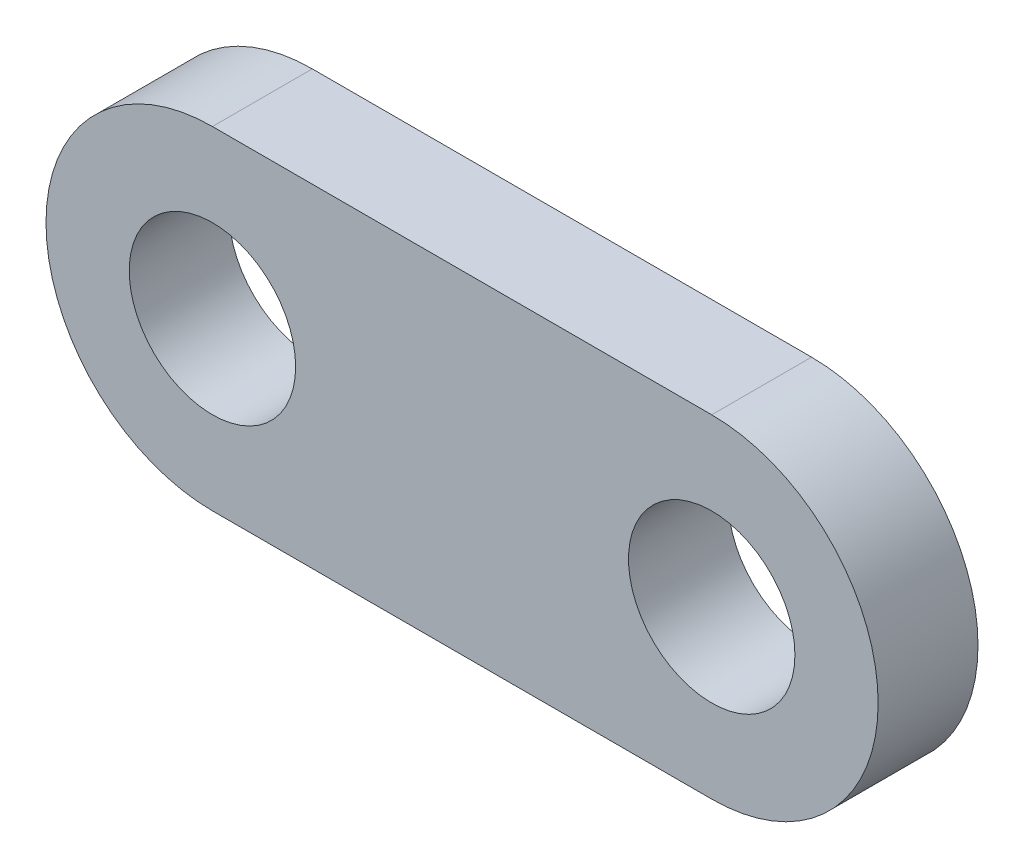
ISO-10303-21;
HEADER;
FILE_DESCRIPTION(('STEP AP214'),'2;1');
FILE_NAME('part.step','',(''),(''),'','','');
FILE_SCHEMA(('AUTOMOTIVE_DESIGN { 1 0 10303 214 1 1 1 1 }'));
ENDSEC;
DATA;
#1=APPLICATION_CONTEXT('core data for automotive mechanical design processes');
#2=APPLICATION_PROTOCOL_DEFINITION('international standard','automotive_design',2000,#1);
#3=PRODUCT_CONTEXT('',#1,'mechanical');
#4=PRODUCT('Part','Part','',(#3));
#5=PRODUCT_RELATED_PRODUCT_CATEGORY('part','',(#4));
#6=PRODUCT_DEFINITION_FORMATION('','',#4);
#7=PRODUCT_DEFINITION_CONTEXT('part definition',#1,'design');
#8=PRODUCT_DEFINITION('design','',#6,#7);
#9=PRODUCT_DEFINITION_SHAPE('','',#8);
#10=(LENGTH_UNIT() NAMED_UNIT(*) SI_UNIT(.MILLI.,.METRE.));
#11=(NAMED_UNIT(*) PLANE_ANGLE_UNIT() SI_UNIT($,.RADIAN.));
#12=(NAMED_UNIT(*) SI_UNIT($,.STERADIAN.) SOLID_ANGLE_UNIT());
#13=UNCERTAINTY_MEASURE_WITH_UNIT(LENGTH_MEASURE(1.E-05),#10,'distance_accuracy_value','');
#14=(GEOMETRIC_REPRESENTATION_CONTEXT(3) GLOBAL_UNCERTAINTY_ASSIGNED_CONTEXT((#13)) GLOBAL_UNIT_ASSIGNED_CONTEXT((#10,
#11,#12)) REPRESENTATION_CONTEXT('',''));
#15=CARTESIAN_POINT('',(0.,0.,0.));
#16=DIRECTION('',(0.,0.,1.));
#17=DIRECTION('',(1.,0.,0.));
#18=AXIS2_PLACEMENT_3D('',#15,#16,#17);
#19=CARTESIAN_POINT('',(-7.5,0.,3.));
#20=DIRECTION('',(0.,0.,1.));
#21=DIRECTION('',(1.,0.,0.));
#22=AXIS2_PLACEMENT_3D('',#19,#20,#21);
#23=PLANE('',#22);
#24=CARTESIAN_POINT('',(7.5,0.,3.));
#25=DIRECTION('',(0.,0.,1.));
#26=DIRECTION('',(1.,0.,0.));
#27=AXIS2_PLACEMENT_3D('',#24,#25,#26);
#28=CIRCLE('',#27,2.5);
#29=CARTESIAN_POINT('',(10.,0.,3.));
#30=VERTEX_POINT('',#29);
#31=EDGE_CURVE('E99',#30,#30,#28,.T.);
#32=ORIENTED_EDGE('',*,*,#31,.F.);
#33=EDGE_LOOP('',(#32));
#34=FACE_BOUND('',#33,.T.);
#35=CARTESIAN_POINT('',(-7.5,0.,3.));
#36=DIRECTION('',(0.,0.,1.));
#37=DIRECTION('',(1.,0.,0.));
#38=AXIS2_PLACEMENT_3D('',#35,#36,#37);
#39=CIRCLE('',#38,5.);
#40=CARTESIAN_POINT('',(-7.5,5.,3.));
#41=VERTEX_POINT('',#40);
#42=CARTESIAN_POINT('',(-7.5,-5.,3.));
#43=VERTEX_POINT('',#42);
#44=EDGE_CURVE('E84',#41,#43,#39,.T.);
#45=ORIENTED_EDGE('',*,*,#44,.T.);
#46=DIRECTION('',(1.,0.,0.));
#47=VECTOR('',#46,1.);
#48=CARTESIAN_POINT('',(-7.5,-5.,3.));
#49=LINE('',#48,#47);
#50=CARTESIAN_POINT('',(7.5,-5.,3.));
#51=VERTEX_POINT('',#50);
#52=EDGE_CURVE('E79',#43,#51,#49,.T.);
#53=ORIENTED_EDGE('',*,*,#52,.T.);
#54=CARTESIAN_POINT('',(7.5,0.,3.));
#55=DIRECTION('',(0.,0.,1.));
#56=DIRECTION('',(1.,0.,0.));
#57=AXIS2_PLACEMENT_3D('',#54,#55,#56);
#58=CIRCLE('',#57,5.);
#59=CARTESIAN_POINT('',(7.5,5.00000000000001,3.));
#60=VERTEX_POINT('',#59);
#61=EDGE_CURVE('E82',#51,#60,#58,.T.);
#62=ORIENTED_EDGE('',*,*,#61,.T.);
#63=DIRECTION('',(-1.,0.,0.));
#64=VECTOR('',#63,1.);
#65=CARTESIAN_POINT('',(-7.5,5.,3.));
#66=LINE('',#65,#64);
#67=EDGE_CURVE('E49',#60,#41,#66,.T.);
#68=ORIENTED_EDGE('',*,*,#67,.T.);
#69=EDGE_LOOP('',(#45,#53,#62,#68));
#70=FACE_BOUND('',#69,.T.);
#71=CARTESIAN_POINT('',(-7.5,0.,3.));
#72=DIRECTION('',(0.,0.,1.));
#73=DIRECTION('',(1.,0.,0.));
#74=AXIS2_PLACEMENT_3D('',#71,#72,#73);
#75=CIRCLE('',#74,2.5);
#76=CARTESIAN_POINT('',(-5.,0.,3.));
#77=VERTEX_POINT('',#76);
#78=EDGE_CURVE('E114',#77,#77,#75,.T.);
#79=ORIENTED_EDGE('',*,*,#78,.F.);
#80=EDGE_LOOP('',(#79));
#81=FACE_BOUND('',#80,.T.);
#82=ADVANCED_FACE('F32',(#34,#70,#81),#23,.T.);
#83=CARTESIAN_POINT('',(-7.5,0.,0.));
#84=DIRECTION('',(0.,0.,1.));
#85=DIRECTION('',(1.,0.,0.));
#86=AXIS2_PLACEMENT_3D('',#83,#84,#85);
#87=PLANE('',#86);
#88=CARTESIAN_POINT('',(-7.5,0.,0.));
#89=DIRECTION('',(0.,0.,1.));
#90=DIRECTION('',(1.,0.,0.));
#91=AXIS2_PLACEMENT_3D('',#88,#89,#90);
#92=CIRCLE('',#91,5.);
#93=CARTESIAN_POINT('',(-7.5,5.,0.));
#94=VERTEX_POINT('',#93);
#95=CARTESIAN_POINT('',(-7.5,-5.,0.));
#96=VERTEX_POINT('',#95);
#97=EDGE_CURVE('E96',#94,#96,#92,.T.);
#98=ORIENTED_EDGE('',*,*,#97,.F.);
#99=DIRECTION('',(-1.,0.,0.));
#100=VECTOR('',#99,1.);
#101=CARTESIAN_POINT('',(-7.5,5.,0.));
#102=LINE('',#101,#100);
#103=CARTESIAN_POINT('',(7.5,5.00000000000001,0.));
#104=VERTEX_POINT('',#103);
#105=EDGE_CURVE('E72',#104,#94,#102,.T.);
#106=ORIENTED_EDGE('',*,*,#105,.F.);
#107=CARTESIAN_POINT('',(7.5,0.,0.));
#108=DIRECTION('',(0.,0.,1.));
#109=DIRECTION('',(1.,0.,0.));
#110=AXIS2_PLACEMENT_3D('',#107,#108,#109);
#111=CIRCLE('',#110,5.);
#112=CARTESIAN_POINT('',(7.5,-5.,0.));
#113=VERTEX_POINT('',#112);
#114=EDGE_CURVE('E66',#113,#104,#111,.T.);
#115=ORIENTED_EDGE('',*,*,#114,.F.);
#116=DIRECTION('',(1.,0.,0.));
#117=VECTOR('',#116,1.);
#118=CARTESIAN_POINT('',(-7.5,-5.,0.));
#119=LINE('',#118,#117);
#120=EDGE_CURVE('E88',#96,#113,#119,.T.);
#121=ORIENTED_EDGE('',*,*,#120,.F.);
#122=EDGE_LOOP('',(#98,#106,#115,#121));
#123=FACE_BOUND('',#122,.T.);
#124=CARTESIAN_POINT('',(7.5,0.,0.));
#125=DIRECTION('',(0.,0.,1.));
#126=DIRECTION('',(1.,0.,0.));
#127=AXIS2_PLACEMENT_3D('',#124,#125,#126);
#128=CIRCLE('',#127,2.5);
#129=CARTESIAN_POINT('',(10.,0.,0.));
#130=VERTEX_POINT('',#129);
#131=EDGE_CURVE('E111',#130,#130,#128,.T.);
#132=ORIENTED_EDGE('',*,*,#131,.T.);
#133=EDGE_LOOP('',(#132));
#134=FACE_BOUND('',#133,.T.);
#135=CARTESIAN_POINT('',(-7.5,0.,0.));
#136=DIRECTION('',(0.,0.,1.));
#137=DIRECTION('',(1.,0.,0.));
#138=AXIS2_PLACEMENT_3D('',#135,#136,#137);
#139=CIRCLE('',#138,2.5);
#140=CARTESIAN_POINT('',(-5.,0.,0.));
#141=VERTEX_POINT('',#140);
#142=EDGE_CURVE('E117',#141,#141,#139,.T.);
#143=ORIENTED_EDGE('',*,*,#142,.T.);
#144=EDGE_LOOP('',(#143));
#145=FACE_BOUND('',#144,.T.);
#146=ADVANCED_FACE('F107',(#123,#134,#145),#87,.F.);
#147=CARTESIAN_POINT('',(-7.5,0.,3.));
#148=DIRECTION('',(0.,0.,-1.));
#149=DIRECTION('',(-1.,0.,0.));
#150=AXIS2_PLACEMENT_3D('',#147,#148,#149);
#151=CYLINDRICAL_SURFACE('',#150,5.);
#152=ORIENTED_EDGE('',*,*,#97,.T.);
#153=DIRECTION('',(0.,0.,-1.));
#154=VECTOR('',#153,1.);
#155=CARTESIAN_POINT('',(-7.5,-5.,3.));
#156=LINE('',#155,#154);
#157=EDGE_CURVE('E11',#43,#96,#156,.T.);
#158=ORIENTED_EDGE('',*,*,#157,.F.);
#159=ORIENTED_EDGE('',*,*,#44,.F.);
#160=DIRECTION('',(0.,0.,-1.));
#161=VECTOR('',#160,1.);
#162=CARTESIAN_POINT('',(-7.5,5.,3.));
#163=LINE('',#162,#161);
#164=EDGE_CURVE('E92',#41,#94,#163,.T.);
#165=ORIENTED_EDGE('',*,*,#164,.T.);
#166=EDGE_LOOP('',(#152,#158,#159,#165));
#167=FACE_BOUND('',#166,.T.);
#168=ADVANCED_FACE('F34',(#167),#151,.T.);
#169=CARTESIAN_POINT('',(-7.5,-5.,3.));
#170=DIRECTION('',(0.,1.,0.));
#171=DIRECTION('',(-1.,0.,0.));
#172=AXIS2_PLACEMENT_3D('',#169,#170,#171);
#173=PLANE('',#172);
#174=ORIENTED_EDGE('',*,*,#120,.T.);
#175=DIRECTION('',(0.,0.,-1.));
#176=VECTOR('',#175,1.);
#177=CARTESIAN_POINT('',(7.5,-5.,3.));
#178=LINE('',#177,#176);
#179=EDGE_CURVE('E41',#51,#113,#178,.T.);
#180=ORIENTED_EDGE('',*,*,#179,.F.);
#181=ORIENTED_EDGE('',*,*,#52,.F.);
#182=ORIENTED_EDGE('',*,*,#157,.T.);
#183=EDGE_LOOP('',(#174,#180,#181,#182));
#184=FACE_BOUND('',#183,.T.);
#185=ADVANCED_FACE('F87',(#184),#173,.F.);
#186=CARTESIAN_POINT('',(7.5,0.,3.));
#187=DIRECTION('',(0.,0.,-1.));
#188=DIRECTION('',(-1.,0.,0.));
#189=AXIS2_PLACEMENT_3D('',#186,#187,#188);
#190=CYLINDRICAL_SURFACE('',#189,5.);
#191=ORIENTED_EDGE('',*,*,#114,.T.);
#192=DIRECTION('',(0.,0.,-1.));
#193=VECTOR('',#192,1.);
#194=CARTESIAN_POINT('',(7.5,5.00000000000001,3.));
#195=LINE('',#194,#193);
#196=EDGE_CURVE('E89',#60,#104,#195,.T.);
#197=ORIENTED_EDGE('',*,*,#196,.F.);
#198=ORIENTED_EDGE('',*,*,#61,.F.);
#199=ORIENTED_EDGE('',*,*,#179,.T.);
#200=EDGE_LOOP('',(#191,#197,#198,#199));
#201=FACE_BOUND('',#200,.T.);
#202=ADVANCED_FACE('F90',(#201),#190,.T.);
#203=CARTESIAN_POINT('',(-7.5,5.,3.));
#204=DIRECTION('',(0.,-1.,0.));
#205=DIRECTION('',(1.,0.,0.));
#206=AXIS2_PLACEMENT_3D('',#203,#204,#205);
#207=PLANE('',#206);
#208=ORIENTED_EDGE('',*,*,#105,.T.);
#209=ORIENTED_EDGE('',*,*,#164,.F.);
#210=ORIENTED_EDGE('',*,*,#67,.F.);
#211=ORIENTED_EDGE('',*,*,#196,.T.);
#212=EDGE_LOOP('',(#208,#209,#210,#211));
#213=FACE_BOUND('',#212,.T.);
#214=ADVANCED_FACE('F104',(#213),#207,.F.);
#215=CARTESIAN_POINT('',(7.5,0.,3.));
#216=DIRECTION('',(0.,0.,-1.));
#217=DIRECTION('',(-1.,0.,0.));
#218=AXIS2_PLACEMENT_3D('',#215,#216,#217);
#219=CYLINDRICAL_SURFACE('',#218,2.5);
#220=ORIENTED_EDGE('',*,*,#31,.T.);
#221=EDGE_LOOP('',(#220));
#222=FACE_BOUND('',#221,.T.);
#223=ORIENTED_EDGE('',*,*,#131,.F.);
#224=EDGE_LOOP('',(#223));
#225=FACE_BOUND('',#224,.T.);
#226=ADVANCED_FACE('F134',(#222,#225),#219,.F.);
#227=CARTESIAN_POINT('',(-7.5,0.,3.));
#228=DIRECTION('',(0.,0.,-1.));
#229=DIRECTION('',(-1.,0.,0.));
#230=AXIS2_PLACEMENT_3D('',#227,#228,#229);
#231=CYLINDRICAL_SURFACE('',#230,2.5);
#232=ORIENTED_EDGE('',*,*,#78,.T.);
#233=EDGE_LOOP('',(#232));
#234=FACE_BOUND('',#233,.T.);
#235=ORIENTED_EDGE('',*,*,#142,.F.);
#236=EDGE_LOOP('',(#235));
#237=FACE_BOUND('',#236,.T.);
#238=ADVANCED_FACE('F123',(#234,#237),#231,.F.);
#239=CLOSED_SHELL('',(#82,#146,#168,#185,#202,#214,#226,#238));
#240=MANIFOLD_SOLID_BREP('B2',#239);
#241=ADVANCED_BREP_SHAPE_REPRESENTATION('',(#18,#240),#14);
#242=SHAPE_DEFINITION_REPRESENTATION(#9,#241);
ENDSEC;
END-ISO-10303-21;
